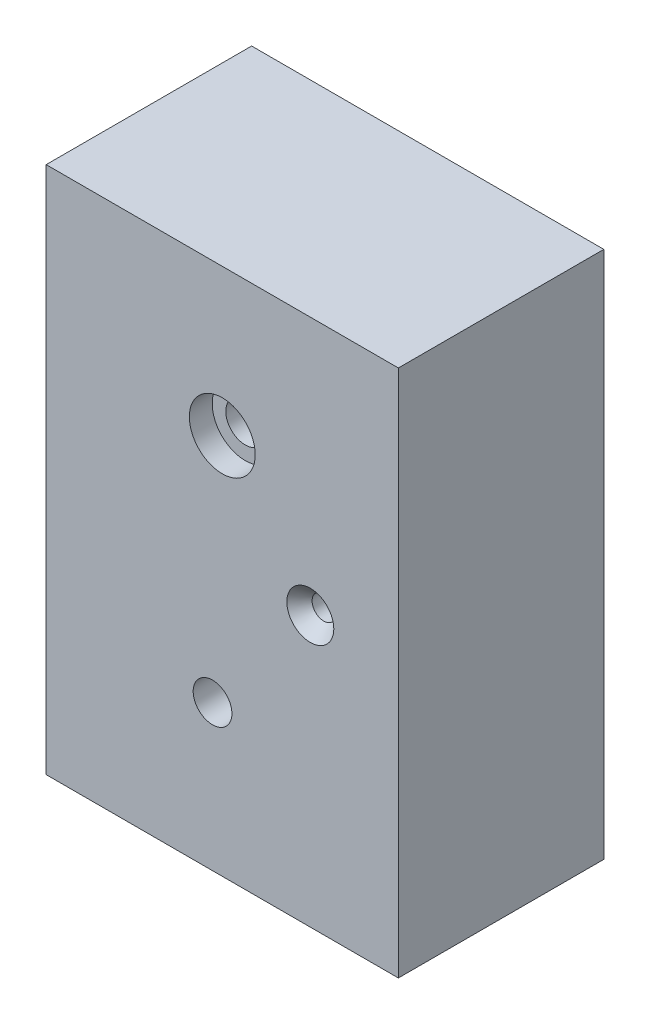
ISO-10303-21;
HEADER;
FILE_DESCRIPTION(('STEP AP214'),'2;1');
FILE_NAME('part.step','',(''),(''),'','','');
FILE_SCHEMA(('AUTOMOTIVE_DESIGN { 1 0 10303 214 1 1 1 1 }'));
ENDSEC;
DATA;
#1=APPLICATION_CONTEXT('core data for automotive mechanical design processes');
#2=APPLICATION_PROTOCOL_DEFINITION('international standard','automotive_design',2000,#1);
#3=PRODUCT_CONTEXT('',#1,'mechanical');
#4=PRODUCT('Part','Part','',(#3));
#5=PRODUCT_RELATED_PRODUCT_CATEGORY('part','',(#4));
#6=PRODUCT_DEFINITION_FORMATION('','',#4);
#7=PRODUCT_DEFINITION_CONTEXT('part definition',#1,'design');
#8=PRODUCT_DEFINITION('design','',#6,#7);
#9=PRODUCT_DEFINITION_SHAPE('','',#8);
#10=(LENGTH_UNIT() NAMED_UNIT(*) SI_UNIT(.MILLI.,.METRE.));
#11=(NAMED_UNIT(*) PLANE_ANGLE_UNIT() SI_UNIT($,.RADIAN.));
#12=(NAMED_UNIT(*) SI_UNIT($,.STERADIAN.) SOLID_ANGLE_UNIT());
#13=UNCERTAINTY_MEASURE_WITH_UNIT(LENGTH_MEASURE(1.E-05),#10,'distance_accuracy_value','');
#14=(GEOMETRIC_REPRESENTATION_CONTEXT(3) GLOBAL_UNCERTAINTY_ASSIGNED_CONTEXT((#13)) GLOBAL_UNIT_ASSIGNED_CONTEXT((#10,
#11,#12)) REPRESENTATION_CONTEXT('',''));
#15=CARTESIAN_POINT('',(0.,0.,0.));
#16=DIRECTION('',(0.,0.,1.));
#17=DIRECTION('',(1.,0.,0.));
#18=AXIS2_PLACEMENT_3D('',#15,#16,#17);
#19=CARTESIAN_POINT('',(0.,0.,0.));
#20=DIRECTION('',(0.,0.,-1.));
#21=DIRECTION('',(-1.,0.,0.));
#22=AXIS2_PLACEMENT_3D('',#19,#20,#21);
#23=PLANE('',#22);
#24=CARTESIAN_POINT('',(225.,230.,0.));
#25=DIRECTION('',(0.,0.,1.));
#26=DIRECTION('',(1.,0.,0.));
#27=AXIS2_PLACEMENT_3D('',#24,#25,#26);
#28=CIRCLE('',#27,10.);
#29=CARTESIAN_POINT('',(235.,230.,0.));
#30=VERTEX_POINT('',#29);
#31=EDGE_CURVE('E130',#30,#30,#28,.T.);
#32=ORIENTED_EDGE('',*,*,#31,.T.);
#33=EDGE_LOOP('',(#32));
#34=FACE_BOUND('',#33,.T.);
#35=CARTESIAN_POINT('',(141.698240344496,124.123333407681,0.));
#36=DIRECTION('',(0.,0.,1.));
#37=DIRECTION('',(1.,0.,0.));
#38=AXIS2_PLACEMENT_3D('',#35,#36,#37);
#39=CIRCLE('',#38,16.5);
#40=CARTESIAN_POINT('',(158.198240344496,124.123333407681,0.));
#41=VERTEX_POINT('',#40);
#42=EDGE_CURVE('E120',#41,#41,#39,.T.);
#43=ORIENTED_EDGE('',*,*,#42,.T.);
#44=EDGE_LOOP('',(#43));
#45=FACE_BOUND('',#44,.T.);
#46=DIRECTION('',(0.,-1.,0.));
#47=VECTOR('',#46,1.);
#48=CARTESIAN_POINT('',(0.,0.,0.));
#49=LINE('',#48,#47);
#50=CARTESIAN_POINT('',(0.,450.,0.));
#51=VERTEX_POINT('',#50);
#52=CARTESIAN_POINT('',(0.,0.,0.));
#53=VERTEX_POINT('',#52);
#54=EDGE_CURVE('E99',#51,#53,#49,.T.);
#55=ORIENTED_EDGE('',*,*,#54,.F.);
#56=DIRECTION('',(-1.,0.,0.));
#57=VECTOR('',#56,1.);
#58=CARTESIAN_POINT('',(0.,450.,0.));
#59=LINE('',#58,#57);
#60=CARTESIAN_POINT('',(300.,450.,0.));
#61=VERTEX_POINT('',#60);
#62=EDGE_CURVE('E75',#61,#51,#59,.T.);
#63=ORIENTED_EDGE('',*,*,#62,.F.);
#64=DIRECTION('',(0.,1.,0.));
#65=VECTOR('',#64,1.);
#66=CARTESIAN_POINT('',(300.,0.,0.));
#67=LINE('',#66,#65);
#68=CARTESIAN_POINT('',(300.,0.,0.));
#69=VERTEX_POINT('',#68);
#70=EDGE_CURVE('E69',#69,#61,#67,.T.);
#71=ORIENTED_EDGE('',*,*,#70,.F.);
#72=DIRECTION('',(1.,0.,0.));
#73=VECTOR('',#72,1.);
#74=CARTESIAN_POINT('',(0.,0.,0.));
#75=LINE('',#74,#73);
#76=EDGE_CURVE('E91',#53,#69,#75,.T.);
#77=ORIENTED_EDGE('',*,*,#76,.F.);
#78=EDGE_LOOP('',(#55,#63,#71,#77));
#79=FACE_BOUND('',#78,.T.);
#80=CARTESIAN_POINT('',(150.,325.,0.));
#81=DIRECTION('',(0.,0.,-1.));
#82=DIRECTION('',(-1.,0.,0.));
#83=AXIS2_PLACEMENT_3D('',#80,#81,#82);
#84=CIRCLE('',#83,16.5);
#85=CARTESIAN_POINT('',(133.5,325.,0.));
#86=VERTEX_POINT('',#85);
#87=EDGE_CURVE('E113',#86,#86,#84,.F.);
#88=ORIENTED_EDGE('',*,*,#87,.T.);
#89=EDGE_LOOP('',(#88));
#90=FACE_BOUND('',#89,.T.);
#91=ADVANCED_FACE('F35',(#34,#45,#79,#90),#23,.T.);
#92=CARTESIAN_POINT('',(0.,0.,175.));
#93=DIRECTION('',(1.,0.,0.));
#94=DIRECTION('',(0.,0.,-1.));
#95=AXIS2_PLACEMENT_3D('',#92,#93,#94);
#96=PLANE('',#95);
#97=ORIENTED_EDGE('',*,*,#54,.T.);
#98=DIRECTION('',(0.,0.,-1.));
#99=VECTOR('',#98,1.);
#100=CARTESIAN_POINT('',(0.,0.,175.));
#101=LINE('',#100,#99);
#102=CARTESIAN_POINT('',(0.,0.,175.));
#103=VERTEX_POINT('',#102);
#104=EDGE_CURVE('E11',#103,#53,#101,.T.);
#105=ORIENTED_EDGE('',*,*,#104,.F.);
#106=DIRECTION('',(0.,-1.,0.));
#107=VECTOR('',#106,1.);
#108=CARTESIAN_POINT('',(0.,0.,175.));
#109=LINE('',#108,#107);
#110=CARTESIAN_POINT('',(0.,450.,175.));
#111=VERTEX_POINT('',#110);
#112=EDGE_CURVE('E87',#111,#103,#109,.T.);
#113=ORIENTED_EDGE('',*,*,#112,.F.);
#114=DIRECTION('',(0.,0.,-1.));
#115=VECTOR('',#114,1.);
#116=CARTESIAN_POINT('',(0.,450.,175.));
#117=LINE('',#116,#115);
#118=EDGE_CURVE('E95',#111,#51,#117,.T.);
#119=ORIENTED_EDGE('',*,*,#118,.T.);
#120=EDGE_LOOP('',(#97,#105,#113,#119));
#121=FACE_BOUND('',#120,.T.);
#122=ADVANCED_FACE('F37',(#121),#96,.F.);
#123=CARTESIAN_POINT('',(0.,0.,175.));
#124=DIRECTION('',(0.,1.,0.));
#125=DIRECTION('',(0.,0.,1.));
#126=AXIS2_PLACEMENT_3D('',#123,#124,#125);
#127=PLANE('',#126);
#128=ORIENTED_EDGE('',*,*,#76,.T.);
#129=DIRECTION('',(0.,0.,-1.));
#130=VECTOR('',#129,1.);
#131=CARTESIAN_POINT('',(300.,0.,175.));
#132=LINE('',#131,#130);
#133=CARTESIAN_POINT('',(300.,0.,175.));
#134=VERTEX_POINT('',#133);
#135=EDGE_CURVE('E44',#134,#69,#132,.T.);
#136=ORIENTED_EDGE('',*,*,#135,.F.);
#137=DIRECTION('',(1.,0.,0.));
#138=VECTOR('',#137,1.);
#139=CARTESIAN_POINT('',(0.,0.,175.));
#140=LINE('',#139,#138);
#141=EDGE_CURVE('E82',#103,#134,#140,.T.);
#142=ORIENTED_EDGE('',*,*,#141,.F.);
#143=ORIENTED_EDGE('',*,*,#104,.T.);
#144=EDGE_LOOP('',(#128,#136,#142,#143));
#145=FACE_BOUND('',#144,.T.);
#146=ADVANCED_FACE('F90',(#145),#127,.F.);
#147=CARTESIAN_POINT('',(300.,0.,175.));
#148=DIRECTION('',(-1.,0.,0.));
#149=DIRECTION('',(0.,0.,1.));
#150=AXIS2_PLACEMENT_3D('',#147,#148,#149);
#151=PLANE('',#150);
#152=ORIENTED_EDGE('',*,*,#70,.T.);
#153=DIRECTION('',(0.,0.,-1.));
#154=VECTOR('',#153,1.);
#155=CARTESIAN_POINT('',(300.,450.,175.));
#156=LINE('',#155,#154);
#157=CARTESIAN_POINT('',(300.,450.,175.));
#158=VERTEX_POINT('',#157);
#159=EDGE_CURVE('E92',#158,#61,#156,.T.);
#160=ORIENTED_EDGE('',*,*,#159,.F.);
#161=DIRECTION('',(0.,1.,0.));
#162=VECTOR('',#161,1.);
#163=CARTESIAN_POINT('',(300.,0.,175.));
#164=LINE('',#163,#162);
#165=EDGE_CURVE('E85',#134,#158,#164,.T.);
#166=ORIENTED_EDGE('',*,*,#165,.F.);
#167=ORIENTED_EDGE('',*,*,#135,.T.);
#168=EDGE_LOOP('',(#152,#160,#166,#167));
#169=FACE_BOUND('',#168,.T.);
#170=ADVANCED_FACE('F93',(#169),#151,.F.);
#171=CARTESIAN_POINT('',(0.,450.,175.));
#172=DIRECTION('',(0.,-1.,0.));
#173=DIRECTION('',(0.,0.,-1.));
#174=AXIS2_PLACEMENT_3D('',#171,#172,#173);
#175=PLANE('',#174);
#176=ORIENTED_EDGE('',*,*,#62,.T.);
#177=ORIENTED_EDGE('',*,*,#118,.F.);
#178=DIRECTION('',(-1.,0.,0.));
#179=VECTOR('',#178,1.);
#180=CARTESIAN_POINT('',(0.,450.,175.));
#181=LINE('',#180,#179);
#182=EDGE_CURVE('E52',#158,#111,#181,.T.);
#183=ORIENTED_EDGE('',*,*,#182,.F.);
#184=ORIENTED_EDGE('',*,*,#159,.T.);
#185=EDGE_LOOP('',(#176,#177,#183,#184));
#186=FACE_BOUND('',#185,.T.);
#187=ADVANCED_FACE('F107',(#186),#175,.F.);
#188=CARTESIAN_POINT('',(0.,0.,175.));
#189=DIRECTION('',(0.,0.,-1.));
#190=DIRECTION('',(-1.,0.,0.));
#191=AXIS2_PLACEMENT_3D('',#188,#189,#190);
#192=PLANE('',#191);
#193=CARTESIAN_POINT('',(225.,230.,175.));
#194=DIRECTION('',(0.,0.,1.));
#195=DIRECTION('',(1.,0.,0.));
#196=AXIS2_PLACEMENT_3D('',#193,#194,#195);
#197=CIRCLE('',#196,20.);
#198=CARTESIAN_POINT('',(245.,230.,175.));
#199=VERTEX_POINT('',#198);
#200=EDGE_CURVE('E136',#199,#199,#197,.T.);
#201=ORIENTED_EDGE('',*,*,#200,.F.);
#202=EDGE_LOOP('',(#201));
#203=FACE_BOUND('',#202,.T.);
#204=CARTESIAN_POINT('',(141.698240344496,124.123333407681,175.));
#205=DIRECTION('',(0.,0.,1.));
#206=DIRECTION('',(1.,0.,0.));
#207=AXIS2_PLACEMENT_3D('',#204,#205,#206);
#208=CIRCLE('',#207,16.5);
#209=CARTESIAN_POINT('',(158.198240344496,124.123333407681,175.));
#210=VERTEX_POINT('',#209);
#211=EDGE_CURVE('E127',#210,#210,#208,.T.);
#212=ORIENTED_EDGE('',*,*,#211,.F.);
#213=EDGE_LOOP('',(#212));
#214=FACE_BOUND('',#213,.T.);
#215=CARTESIAN_POINT('',(150.,325.,175.));
#216=DIRECTION('',(0.,0.,1.));
#217=DIRECTION('',(1.,0.,0.));
#218=AXIS2_PLACEMENT_3D('',#215,#216,#217);
#219=CIRCLE('',#218,28.06);
#220=CARTESIAN_POINT('',(178.06,325.,175.));
#221=VERTEX_POINT('',#220);
#222=EDGE_CURVE('E117',#221,#221,#219,.T.);
#223=ORIENTED_EDGE('',*,*,#222,.F.);
#224=EDGE_LOOP('',(#223));
#225=FACE_BOUND('',#224,.T.);
#226=ORIENTED_EDGE('',*,*,#112,.T.);
#227=ORIENTED_EDGE('',*,*,#141,.T.);
#228=ORIENTED_EDGE('',*,*,#165,.T.);
#229=ORIENTED_EDGE('',*,*,#182,.T.);
#230=EDGE_LOOP('',(#226,#227,#228,#229));
#231=FACE_BOUND('',#230,.T.);
#232=ADVANCED_FACE('F83',(#203,#214,#225,#231),#192,.F.);
#233=CARTESIAN_POINT('',(150.,325.,175.));
#234=DIRECTION('',(0.,0.,1.));
#235=DIRECTION('',(1.,0.,0.));
#236=AXIS2_PLACEMENT_3D('',#233,#234,#235);
#237=CYLINDRICAL_SURFACE('',#236,16.5);
#238=ORIENTED_EDGE('',*,*,#87,.F.);
#239=EDGE_LOOP('',(#238));
#240=FACE_BOUND('',#239,.T.);
#241=CARTESIAN_POINT('',(150.,325.,155.52));
#242=DIRECTION('',(0.,0.,1.));
#243=DIRECTION('',(1.,0.,0.));
#244=AXIS2_PLACEMENT_3D('',#241,#242,#243);
#245=CIRCLE('',#244,16.5);
#246=CARTESIAN_POINT('',(166.5,325.,155.52));
#247=VERTEX_POINT('',#246);
#248=EDGE_CURVE('E116',#247,#247,#245,.T.);
#249=ORIENTED_EDGE('',*,*,#248,.T.);
#250=EDGE_LOOP('',(#249));
#251=FACE_BOUND('',#250,.T.);
#252=ADVANCED_FACE('F144',(#240,#251),#237,.F.);
#253=CARTESIAN_POINT('',(166.5,325.,155.52));
#254=DIRECTION('',(0.,0.,-1.));
#255=DIRECTION('',(-1.,0.,0.));
#256=AXIS2_PLACEMENT_3D('',#253,#254,#255);
#257=PLANE('',#256);
#258=ORIENTED_EDGE('',*,*,#248,.F.);
#259=EDGE_LOOP('',(#258));
#260=FACE_BOUND('',#259,.T.);
#261=CARTESIAN_POINT('',(150.,325.,155.52));
#262=DIRECTION('',(0.,0.,1.));
#263=DIRECTION('',(1.,0.,0.));
#264=AXIS2_PLACEMENT_3D('',#261,#262,#263);
#265=CIRCLE('',#264,28.06);
#266=CARTESIAN_POINT('',(178.06,325.,155.52));
#267=VERTEX_POINT('',#266);
#268=EDGE_CURVE('E102',#267,#267,#265,.T.);
#269=ORIENTED_EDGE('',*,*,#268,.T.);
#270=EDGE_LOOP('',(#269));
#271=FACE_BOUND('',#270,.T.);
#272=ADVANCED_FACE('F153',(#260,#271),#257,.F.);
#273=CARTESIAN_POINT('',(150.,325.,175.));
#274=DIRECTION('',(0.,0.,1.));
#275=DIRECTION('',(1.,0.,0.));
#276=AXIS2_PLACEMENT_3D('',#273,#274,#275);
#277=CYLINDRICAL_SURFACE('',#276,28.06);
#278=ORIENTED_EDGE('',*,*,#268,.F.);
#279=EDGE_LOOP('',(#278));
#280=FACE_BOUND('',#279,.T.);
#281=ORIENTED_EDGE('',*,*,#222,.T.);
#282=EDGE_LOOP('',(#281));
#283=FACE_BOUND('',#282,.T.);
#284=ADVANCED_FACE('F150',(#280,#283),#277,.F.);
#285=CARTESIAN_POINT('',(141.698240344496,124.123333407681,175.));
#286=DIRECTION('',(0.,0.,1.));
#287=DIRECTION('',(1.,0.,0.));
#288=AXIS2_PLACEMENT_3D('',#285,#286,#287);
#289=CYLINDRICAL_SURFACE('',#288,16.5);
#290=ORIENTED_EDGE('',*,*,#42,.F.);
#291=EDGE_LOOP('',(#290));
#292=FACE_BOUND('',#291,.T.);
#293=ORIENTED_EDGE('',*,*,#211,.T.);
#294=EDGE_LOOP('',(#293));
#295=FACE_BOUND('',#294,.T.);
#296=ADVANCED_FACE('F152',(#292,#295),#289,.F.);
#297=CARTESIAN_POINT('',(225.,230.,175.));
#298=DIRECTION('',(0.,0.,1.));
#299=DIRECTION('',(1.,0.,0.));
#300=AXIS2_PLACEMENT_3D('',#297,#298,#299);
#301=CYLINDRICAL_SURFACE('',#300,9.99999999999999);
#302=ORIENTED_EDGE('',*,*,#31,.F.);
#303=EDGE_LOOP('',(#302));
#304=FACE_BOUND('',#303,.T.);
#305=CARTESIAN_POINT('',(225.,230.,163.49631592779));
#306=DIRECTION('',(0.,0.,1.));
#307=DIRECTION('',(1.,0.,0.));
#308=AXIS2_PLACEMENT_3D('',#305,#306,#307);
#309=CIRCLE('',#308,9.99999999999998);
#310=CARTESIAN_POINT('',(235.,230.,163.49631592779));
#311=VERTEX_POINT('',#310);
#312=EDGE_CURVE('E133',#311,#311,#309,.T.);
#313=ORIENTED_EDGE('',*,*,#312,.T.);
#314=EDGE_LOOP('',(#313));
#315=FACE_BOUND('',#314,.T.);
#316=ADVANCED_FACE('F160',(#304,#315),#301,.F.);
#317=CARTESIAN_POINT('',(225.,230.,175.));
#318=DIRECTION('',(0.,0.,1.));
#319=DIRECTION('',(1.,0.,0.));
#320=AXIS2_PLACEMENT_3D('',#317,#318,#319);
#321=CONICAL_SURFACE('',#320,20.,0.715584993317676);
#322=ORIENTED_EDGE('',*,*,#312,.F.);
#323=EDGE_LOOP('',(#322));
#324=FACE_BOUND('',#323,.T.);
#325=ORIENTED_EDGE('',*,*,#200,.T.);
#326=EDGE_LOOP('',(#325));
#327=FACE_BOUND('',#326,.T.);
#328=ADVANCED_FACE('F140',(#324,#327),#321,.F.);
#329=CLOSED_SHELL('',(#91,#122,#146,#170,#187,#232,#252,#272,#284,#296,#316,#328));
#330=MANIFOLD_SOLID_BREP('B2',#329);
#331=ADVANCED_BREP_SHAPE_REPRESENTATION('',(#18,#330),#14);
#332=SHAPE_DEFINITION_REPRESENTATION(#9,#331);
ENDSEC;
END-ISO-10303-21;
